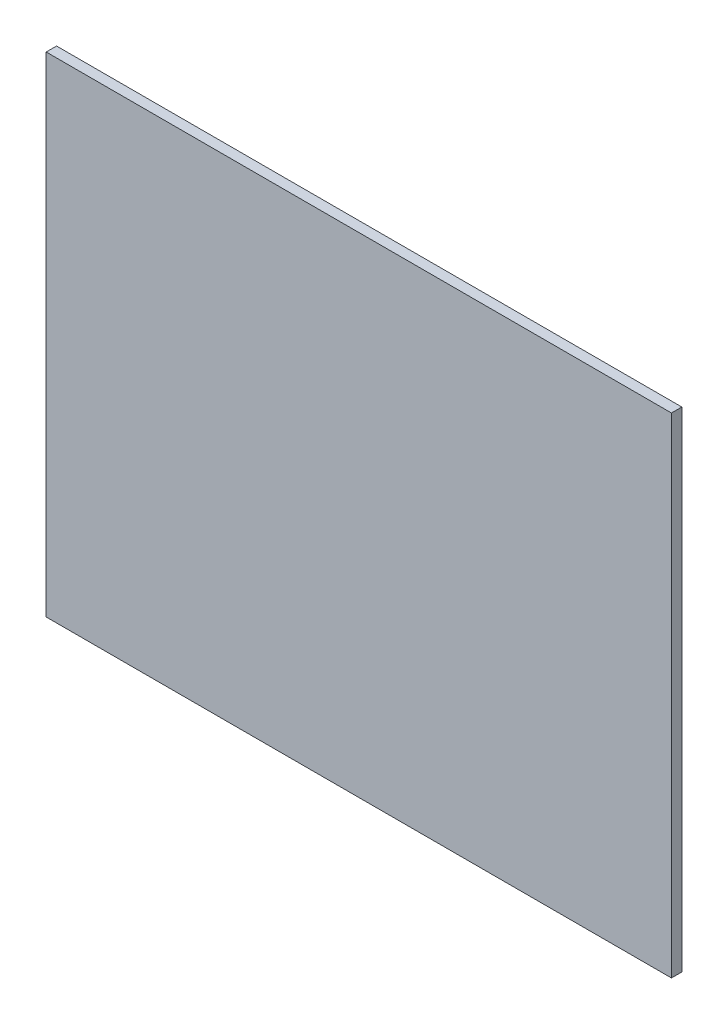
ISO-10303-21;
HEADER;
FILE_DESCRIPTION(('STEP AP214'),'2;1');
FILE_NAME('part.step','',(''),(''),'','','');
FILE_SCHEMA(('AUTOMOTIVE_DESIGN { 1 0 10303 214 1 1 1 1 }'));
ENDSEC;
DATA;
#1=APPLICATION_CONTEXT('core data for automotive mechanical design processes');
#2=APPLICATION_PROTOCOL_DEFINITION('international standard','automotive_design',2000,#1);
#3=PRODUCT_CONTEXT('',#1,'mechanical');
#4=PRODUCT('Part','Part','',(#3));
#5=PRODUCT_RELATED_PRODUCT_CATEGORY('part','',(#4));
#6=PRODUCT_DEFINITION_FORMATION('','',#4);
#7=PRODUCT_DEFINITION_CONTEXT('part definition',#1,'design');
#8=PRODUCT_DEFINITION('design','',#6,#7);
#9=PRODUCT_DEFINITION_SHAPE('','',#8);
#10=(LENGTH_UNIT() NAMED_UNIT(*) SI_UNIT(.MILLI.,.METRE.));
#11=(NAMED_UNIT(*) PLANE_ANGLE_UNIT() SI_UNIT($,.RADIAN.));
#12=(NAMED_UNIT(*) SI_UNIT($,.STERADIAN.) SOLID_ANGLE_UNIT());
#13=UNCERTAINTY_MEASURE_WITH_UNIT(LENGTH_MEASURE(1.E-05),#10,'distance_accuracy_value','');
#14=(GEOMETRIC_REPRESENTATION_CONTEXT(3) GLOBAL_UNCERTAINTY_ASSIGNED_CONTEXT((#13)) GLOBAL_UNIT_ASSIGNED_CONTEXT((#10,
#11,#12)) REPRESENTATION_CONTEXT('',''));
#15=CARTESIAN_POINT('',(0.,0.,0.));
#16=DIRECTION('',(0.,0.,1.));
#17=DIRECTION('',(1.,0.,0.));
#18=AXIS2_PLACEMENT_3D('',#15,#16,#17);
#19=CARTESIAN_POINT('',(0.,0.,19.05));
#20=DIRECTION('',(1.,0.,0.));
#21=DIRECTION('',(0.,1.,0.));
#22=AXIS2_PLACEMENT_3D('',#19,#20,#21);
#23=PLANE('',#22);
#24=DIRECTION('',(0.,-1.,0.));
#25=VECTOR('',#24,1.);
#26=CARTESIAN_POINT('',(0.,0.,0.));
#27=LINE('',#26,#25);
#28=CARTESIAN_POINT('',(0.,0.,0.));
#29=VERTEX_POINT('',#28);
#30=CARTESIAN_POINT('',(1.10218211923262E-13,-900.,0.));
#31=VERTEX_POINT('',#30);
#32=EDGE_CURVE('E101',#29,#31,#27,.T.);
#33=ORIENTED_EDGE('',*,*,#32,.T.);
#34=DIRECTION('',(0.,0.,-1.));
#35=VECTOR('',#34,1.);
#36=CARTESIAN_POINT('',(1.10218211923262E-13,-900.,19.05));
#37=LINE('',#36,#35);
#38=CARTESIAN_POINT('',(1.10218211923262E-13,-900.,19.05));
#39=VERTEX_POINT('',#38);
#40=EDGE_CURVE('E11',#39,#31,#37,.T.);
#41=ORIENTED_EDGE('',*,*,#40,.F.);
#42=DIRECTION('',(0.,-1.,0.));
#43=VECTOR('',#42,1.);
#44=CARTESIAN_POINT('',(0.,0.,19.05));
#45=LINE('',#44,#43);
#46=CARTESIAN_POINT('',(0.,0.,19.05));
#47=VERTEX_POINT('',#46);
#48=EDGE_CURVE('E89',#47,#39,#45,.T.);
#49=ORIENTED_EDGE('',*,*,#48,.F.);
#50=DIRECTION('',(0.,0.,-1.));
#51=VECTOR('',#50,1.);
#52=CARTESIAN_POINT('',(0.,0.,19.05));
#53=LINE('',#52,#51);
#54=EDGE_CURVE('E97',#47,#29,#53,.T.);
#55=ORIENTED_EDGE('',*,*,#54,.T.);
#56=EDGE_LOOP('',(#33,#41,#49,#55));
#57=FACE_BOUND('',#56,.T.);
#58=ADVANCED_FACE('F38',(#57),#23,.F.);
#59=CARTESIAN_POINT('',(1.10218211923262E-13,-900.,19.05));
#60=DIRECTION('',(0.,1.,0.));
#61=DIRECTION('',(0.,0.,1.));
#62=AXIS2_PLACEMENT_3D('',#59,#60,#61);
#63=PLANE('',#62);
#64=DIRECTION('',(1.,0.,0.));
#65=VECTOR('',#64,1.);
#66=CARTESIAN_POINT('',(1.10218211923262E-13,-900.,0.));
#67=LINE('',#66,#65);
#68=CARTESIAN_POINT('',(1150.,-900.,0.));
#69=VERTEX_POINT('',#68);
#70=EDGE_CURVE('E93',#31,#69,#67,.T.);
#71=ORIENTED_EDGE('',*,*,#70,.T.);
#72=DIRECTION('',(0.,0.,-1.));
#73=VECTOR('',#72,1.);
#74=CARTESIAN_POINT('',(1150.,-900.,19.05));
#75=LINE('',#74,#73);
#76=CARTESIAN_POINT('',(1150.,-900.,19.05));
#77=VERTEX_POINT('',#76);
#78=EDGE_CURVE('E46',#77,#69,#75,.T.);
#79=ORIENTED_EDGE('',*,*,#78,.F.);
#80=DIRECTION('',(1.,0.,0.));
#81=VECTOR('',#80,1.);
#82=CARTESIAN_POINT('',(1.10218211923262E-13,-900.,19.05));
#83=LINE('',#82,#81);
#84=EDGE_CURVE('E84',#39,#77,#83,.T.);
#85=ORIENTED_EDGE('',*,*,#84,.F.);
#86=ORIENTED_EDGE('',*,*,#40,.T.);
#87=EDGE_LOOP('',(#71,#79,#85,#86));
#88=FACE_BOUND('',#87,.T.);
#89=ADVANCED_FACE('F92',(#88),#63,.F.);
#90=CARTESIAN_POINT('',(1150.,0.,19.05));
#91=DIRECTION('',(-1.,0.,0.));
#92=DIRECTION('',(0.,0.,1.));
#93=AXIS2_PLACEMENT_3D('',#90,#91,#92);
#94=PLANE('',#93);
#95=DIRECTION('',(0.,1.,0.));
#96=VECTOR('',#95,1.);
#97=CARTESIAN_POINT('',(1150.,0.,0.));
#98=LINE('',#97,#96);
#99=CARTESIAN_POINT('',(1150.,0.,0.));
#100=VERTEX_POINT('',#99);
#101=EDGE_CURVE('E71',#69,#100,#98,.T.);
#102=ORIENTED_EDGE('',*,*,#101,.T.);
#103=DIRECTION('',(0.,0.,-1.));
#104=VECTOR('',#103,1.);
#105=CARTESIAN_POINT('',(1150.,0.,19.05));
#106=LINE('',#105,#104);
#107=CARTESIAN_POINT('',(1150.,0.,19.05));
#108=VERTEX_POINT('',#107);
#109=EDGE_CURVE('E94',#108,#100,#106,.T.);
#110=ORIENTED_EDGE('',*,*,#109,.F.);
#111=DIRECTION('',(0.,1.,0.));
#112=VECTOR('',#111,1.);
#113=CARTESIAN_POINT('',(1150.,0.,19.05));
#114=LINE('',#113,#112);
#115=EDGE_CURVE('E87',#77,#108,#114,.T.);
#116=ORIENTED_EDGE('',*,*,#115,.F.);
#117=ORIENTED_EDGE('',*,*,#78,.T.);
#118=EDGE_LOOP('',(#102,#110,#116,#117));
#119=FACE_BOUND('',#118,.T.);
#120=ADVANCED_FACE('F95',(#119),#94,.F.);
#121=CARTESIAN_POINT('',(0.,0.,19.05));
#122=DIRECTION('',(0.,-1.,0.));
#123=DIRECTION('',(0.,0.,-1.));
#124=AXIS2_PLACEMENT_3D('',#121,#122,#123);
#125=PLANE('',#124);
#126=DIRECTION('',(-1.,0.,0.));
#127=VECTOR('',#126,1.);
#128=CARTESIAN_POINT('',(0.,0.,0.));
#129=LINE('',#128,#127);
#130=EDGE_CURVE('E77',#100,#29,#129,.T.);
#131=ORIENTED_EDGE('',*,*,#130,.T.);
#132=ORIENTED_EDGE('',*,*,#54,.F.);
#133=DIRECTION('',(-1.,0.,0.));
#134=VECTOR('',#133,1.);
#135=CARTESIAN_POINT('',(0.,0.,19.05));
#136=LINE('',#135,#134);
#137=EDGE_CURVE('E54',#108,#47,#136,.T.);
#138=ORIENTED_EDGE('',*,*,#137,.F.);
#139=ORIENTED_EDGE('',*,*,#109,.T.);
#140=EDGE_LOOP('',(#131,#132,#138,#139));
#141=FACE_BOUND('',#140,.T.);
#142=ADVANCED_FACE('F108',(#141),#125,.F.);
#143=CARTESIAN_POINT('',(0.,0.,19.05));
#144=DIRECTION('',(0.,0.,1.));
#145=DIRECTION('',(1.,0.,0.));
#146=AXIS2_PLACEMENT_3D('',#143,#144,#145);
#147=PLANE('',#146);
#148=ORIENTED_EDGE('',*,*,#48,.T.);
#149=ORIENTED_EDGE('',*,*,#84,.T.);
#150=ORIENTED_EDGE('',*,*,#115,.T.);
#151=ORIENTED_EDGE('',*,*,#137,.T.);
#152=EDGE_LOOP('',(#148,#149,#150,#151));
#153=FACE_BOUND('',#152,.T.);
#154=ADVANCED_FACE('F85',(#153),#147,.T.);
#155=CARTESIAN_POINT('',(0.,0.,0.));
#156=DIRECTION('',(0.,0.,1.));
#157=DIRECTION('',(1.,0.,0.));
#158=AXIS2_PLACEMENT_3D('',#155,#156,#157);
#159=PLANE('',#158);
#160=ORIENTED_EDGE('',*,*,#32,.F.);
#161=ORIENTED_EDGE('',*,*,#130,.F.);
#162=ORIENTED_EDGE('',*,*,#101,.F.);
#163=ORIENTED_EDGE('',*,*,#70,.F.);
#164=EDGE_LOOP('',(#160,#161,#162,#163));
#165=FACE_BOUND('',#164,.T.);
#166=ADVANCED_FACE('F111',(#165),#159,.F.);
#167=CLOSED_SHELL('',(#58,#89,#120,#142,#154,#166));
#168=MANIFOLD_SOLID_BREP('B2',#167);
#169=ADVANCED_BREP_SHAPE_REPRESENTATION('',(#18,#168),#14);
#170=SHAPE_DEFINITION_REPRESENTATION(#9,#169);
ENDSEC;
END-ISO-10303-21;
